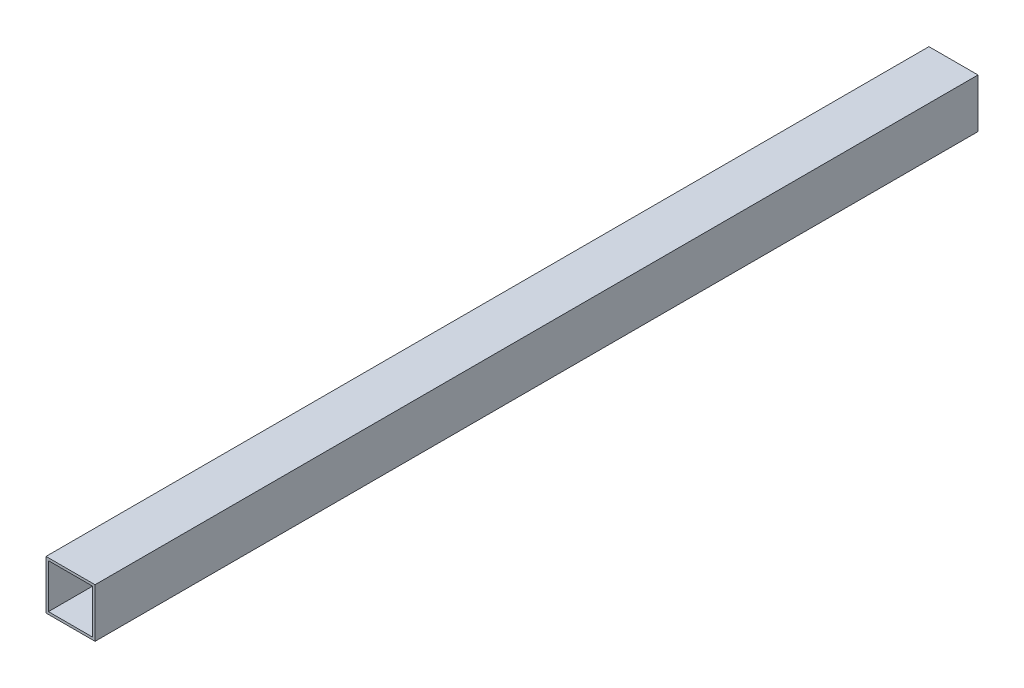
ISO-10303-21;
HEADER;
FILE_DESCRIPTION(('STEP AP214'),'2;1');
FILE_NAME('part.step','',(''),(''),'','','');
FILE_SCHEMA(('AUTOMOTIVE_DESIGN { 1 0 10303 214 1 1 1 1 }'));
ENDSEC;
DATA;
#1=APPLICATION_CONTEXT('core data for automotive mechanical design processes');
#2=APPLICATION_PROTOCOL_DEFINITION('international standard','automotive_design',2000,#1);
#3=PRODUCT_CONTEXT('',#1,'mechanical');
#4=PRODUCT('Part','Part','',(#3));
#5=PRODUCT_RELATED_PRODUCT_CATEGORY('part','',(#4));
#6=PRODUCT_DEFINITION_FORMATION('','',#4);
#7=PRODUCT_DEFINITION_CONTEXT('part definition',#1,'design');
#8=PRODUCT_DEFINITION('design','',#6,#7);
#9=PRODUCT_DEFINITION_SHAPE('','',#8);
#10=(LENGTH_UNIT() NAMED_UNIT(*) SI_UNIT(.MILLI.,.METRE.));
#11=(NAMED_UNIT(*) PLANE_ANGLE_UNIT() SI_UNIT($,.RADIAN.));
#12=(NAMED_UNIT(*) SI_UNIT($,.STERADIAN.) SOLID_ANGLE_UNIT());
#13=UNCERTAINTY_MEASURE_WITH_UNIT(LENGTH_MEASURE(1.E-05),#10,'distance_accuracy_value','');
#14=(GEOMETRIC_REPRESENTATION_CONTEXT(3) GLOBAL_UNCERTAINTY_ASSIGNED_CONTEXT((#13)) GLOBAL_UNIT_ASSIGNED_CONTEXT((#10,
#11,#12)) REPRESENTATION_CONTEXT('',''));
#15=CARTESIAN_POINT('',(0.,0.,0.));
#16=DIRECTION('',(0.,0.,1.));
#17=DIRECTION('',(1.,0.,0.));
#18=AXIS2_PLACEMENT_3D('',#15,#16,#17);
#19=CARTESIAN_POINT('',(0.,0.,360.));
#20=DIRECTION('',(0.,0.,1.));
#21=DIRECTION('',(1.,0.,0.));
#22=AXIS2_PLACEMENT_3D('',#19,#20,#21);
#23=PLANE('',#22);
#24=DIRECTION('',(0.,-1.,0.));
#25=VECTOR('',#24,1.);
#26=CARTESIAN_POINT('',(0.,0.,360.));
#27=LINE('',#26,#25);
#28=CARTESIAN_POINT('',(0.,0.,360.));
#29=VERTEX_POINT('',#28);
#30=CARTESIAN_POINT('',(0.,-20.,360.));
#31=VERTEX_POINT('',#30);
#32=EDGE_CURVE('E134',#29,#31,#27,.T.);
#33=ORIENTED_EDGE('',*,*,#32,.T.);
#34=DIRECTION('',(1.,0.,0.));
#35=VECTOR('',#34,1.);
#36=CARTESIAN_POINT('',(0.,-20.,360.));
#37=LINE('',#36,#35);
#38=CARTESIAN_POINT('',(20.,-20.,360.));
#39=VERTEX_POINT('',#38);
#40=EDGE_CURVE('E137',#31,#39,#37,.T.);
#41=ORIENTED_EDGE('',*,*,#40,.T.);
#42=DIRECTION('',(0.,1.,0.));
#43=VECTOR('',#42,1.);
#44=CARTESIAN_POINT('',(20.,0.,360.));
#45=LINE('',#44,#43);
#46=CARTESIAN_POINT('',(20.,0.,360.));
#47=VERTEX_POINT('',#46);
#48=EDGE_CURVE('E140',#39,#47,#45,.T.);
#49=ORIENTED_EDGE('',*,*,#48,.T.);
#50=DIRECTION('',(-1.,0.,0.));
#51=VECTOR('',#50,1.);
#52=CARTESIAN_POINT('',(0.,0.,360.));
#53=LINE('',#52,#51);
#54=EDGE_CURVE('E142',#47,#29,#53,.T.);
#55=ORIENTED_EDGE('',*,*,#54,.T.);
#56=EDGE_LOOP('',(#33,#41,#49,#55));
#57=FACE_BOUND('',#56,.T.);
#58=DIRECTION('',(-1.,0.,0.));
#59=VECTOR('',#58,1.);
#60=CARTESIAN_POINT('',(1.,-1.,360.));
#61=LINE('',#60,#59);
#62=CARTESIAN_POINT('',(19.,-1.,360.));
#63=VERTEX_POINT('',#62);
#64=CARTESIAN_POINT('',(1.,-1.,360.));
#65=VERTEX_POINT('',#64);
#66=EDGE_CURVE('E106',#63,#65,#61,.T.);
#67=ORIENTED_EDGE('',*,*,#66,.F.);
#68=DIRECTION('',(0.,1.,0.));
#69=VECTOR('',#68,1.);
#70=CARTESIAN_POINT('',(19.,-19.,360.));
#71=LINE('',#70,#69);
#72=CARTESIAN_POINT('',(19.,-19.,360.));
#73=VERTEX_POINT('',#72);
#74=EDGE_CURVE('E98',#73,#63,#71,.T.);
#75=ORIENTED_EDGE('',*,*,#74,.F.);
#76=DIRECTION('',(1.,0.,0.));
#77=VECTOR('',#76,1.);
#78=CARTESIAN_POINT('',(1.,-19.,360.));
#79=LINE('',#78,#77);
#80=CARTESIAN_POINT('',(1.,-19.,360.));
#81=VERTEX_POINT('',#80);
#82=EDGE_CURVE('E120',#81,#73,#79,.T.);
#83=ORIENTED_EDGE('',*,*,#82,.F.);
#84=DIRECTION('',(0.,-1.,0.));
#85=VECTOR('',#84,1.);
#86=CARTESIAN_POINT('',(1.,-19.,360.));
#87=LINE('',#86,#85);
#88=EDGE_CURVE('E118',#65,#81,#87,.T.);
#89=ORIENTED_EDGE('',*,*,#88,.F.);
#90=EDGE_LOOP('',(#67,#75,#83,#89));
#91=FACE_BOUND('',#90,.T.);
#92=ADVANCED_FACE('F33',(#57,#91),#23,.T.);
#93=CARTESIAN_POINT('',(0.,0.,0.));
#94=DIRECTION('',(0.,0.,1.));
#95=DIRECTION('',(1.,0.,0.));
#96=AXIS2_PLACEMENT_3D('',#93,#94,#95);
#97=PLANE('',#96);
#98=DIRECTION('',(0.,-1.,0.));
#99=VECTOR('',#98,1.);
#100=CARTESIAN_POINT('',(0.,0.,0.));
#101=LINE('',#100,#99);
#102=CARTESIAN_POINT('',(0.,0.,0.));
#103=VERTEX_POINT('',#102);
#104=CARTESIAN_POINT('',(0.,-20.,0.));
#105=VERTEX_POINT('',#104);
#106=EDGE_CURVE('E114',#103,#105,#101,.T.);
#107=ORIENTED_EDGE('',*,*,#106,.F.);
#108=DIRECTION('',(-1.,0.,0.));
#109=VECTOR('',#108,1.);
#110=CARTESIAN_POINT('',(0.,0.,0.));
#111=LINE('',#110,#109);
#112=CARTESIAN_POINT('',(20.,0.,0.));
#113=VERTEX_POINT('',#112);
#114=EDGE_CURVE('E138',#113,#103,#111,.T.);
#115=ORIENTED_EDGE('',*,*,#114,.F.);
#116=DIRECTION('',(0.,1.,0.));
#117=VECTOR('',#116,1.);
#118=CARTESIAN_POINT('',(20.,0.,0.));
#119=LINE('',#118,#117);
#120=CARTESIAN_POINT('',(20.,-20.,0.));
#121=VERTEX_POINT('',#120);
#122=EDGE_CURVE('E149',#121,#113,#119,.T.);
#123=ORIENTED_EDGE('',*,*,#122,.F.);
#124=DIRECTION('',(1.,0.,0.));
#125=VECTOR('',#124,1.);
#126=CARTESIAN_POINT('',(0.,-20.,0.));
#127=LINE('',#126,#125);
#128=EDGE_CURVE('E147',#105,#121,#127,.T.);
#129=ORIENTED_EDGE('',*,*,#128,.F.);
#130=EDGE_LOOP('',(#107,#115,#123,#129));
#131=FACE_BOUND('',#130,.T.);
#132=DIRECTION('',(0.,1.,0.));
#133=VECTOR('',#132,1.);
#134=CARTESIAN_POINT('',(19.,-19.,0.));
#135=LINE('',#134,#133);
#136=CARTESIAN_POINT('',(19.,-19.,0.));
#137=VERTEX_POINT('',#136);
#138=CARTESIAN_POINT('',(19.,-1.,0.));
#139=VERTEX_POINT('',#138);
#140=EDGE_CURVE('E56',#137,#139,#135,.T.);
#141=ORIENTED_EDGE('',*,*,#140,.T.);
#142=DIRECTION('',(-1.,0.,0.));
#143=VECTOR('',#142,1.);
#144=CARTESIAN_POINT('',(1.,-1.,0.));
#145=LINE('',#144,#143);
#146=CARTESIAN_POINT('',(1.,-1.,0.));
#147=VERTEX_POINT('',#146);
#148=EDGE_CURVE('E113',#139,#147,#145,.T.);
#149=ORIENTED_EDGE('',*,*,#148,.T.);
#150=DIRECTION('',(0.,-1.,0.));
#151=VECTOR('',#150,1.);
#152=CARTESIAN_POINT('',(1.,-19.,0.));
#153=LINE('',#152,#151);
#154=CARTESIAN_POINT('',(1.,-19.,0.));
#155=VERTEX_POINT('',#154);
#156=EDGE_CURVE('E126',#147,#155,#153,.T.);
#157=ORIENTED_EDGE('',*,*,#156,.T.);
#158=DIRECTION('',(1.,0.,0.));
#159=VECTOR('',#158,1.);
#160=CARTESIAN_POINT('',(1.,-19.,0.));
#161=LINE('',#160,#159);
#162=EDGE_CURVE('E107',#155,#137,#161,.T.);
#163=ORIENTED_EDGE('',*,*,#162,.T.);
#164=EDGE_LOOP('',(#141,#149,#157,#163));
#165=FACE_BOUND('',#164,.T.);
#166=ADVANCED_FACE('F167',(#131,#165),#97,.F.);
#167=CARTESIAN_POINT('',(0.,0.,360.));
#168=DIRECTION('',(1.,0.,0.));
#169=DIRECTION('',(0.,0.,-1.));
#170=AXIS2_PLACEMENT_3D('',#167,#168,#169);
#171=PLANE('',#170);
#172=ORIENTED_EDGE('',*,*,#106,.T.);
#173=DIRECTION('',(0.,0.,-1.));
#174=VECTOR('',#173,1.);
#175=CARTESIAN_POINT('',(0.,-20.,360.));
#176=LINE('',#175,#174);
#177=EDGE_CURVE('E11',#31,#105,#176,.T.);
#178=ORIENTED_EDGE('',*,*,#177,.F.);
#179=ORIENTED_EDGE('',*,*,#32,.F.);
#180=DIRECTION('',(0.,0.,-1.));
#181=VECTOR('',#180,1.);
#182=CARTESIAN_POINT('',(0.,0.,360.));
#183=LINE('',#182,#181);
#184=EDGE_CURVE('E144',#29,#103,#183,.T.);
#185=ORIENTED_EDGE('',*,*,#184,.T.);
#186=EDGE_LOOP('',(#172,#178,#179,#185));
#187=FACE_BOUND('',#186,.T.);
#188=ADVANCED_FACE('F35',(#187),#171,.F.);
#189=CARTESIAN_POINT('',(0.,-20.,360.));
#190=DIRECTION('',(0.,1.,0.));
#191=DIRECTION('',(0.,0.,1.));
#192=AXIS2_PLACEMENT_3D('',#189,#190,#191);
#193=PLANE('',#192);
#194=ORIENTED_EDGE('',*,*,#128,.T.);
#195=DIRECTION('',(0.,0.,-1.));
#196=VECTOR('',#195,1.);
#197=CARTESIAN_POINT('',(20.,-20.,360.));
#198=LINE('',#197,#196);
#199=EDGE_CURVE('E41',#39,#121,#198,.T.);
#200=ORIENTED_EDGE('',*,*,#199,.F.);
#201=ORIENTED_EDGE('',*,*,#40,.F.);
#202=ORIENTED_EDGE('',*,*,#177,.T.);
#203=EDGE_LOOP('',(#194,#200,#201,#202));
#204=FACE_BOUND('',#203,.T.);
#205=ADVANCED_FACE('F177',(#204),#193,.F.);
#206=CARTESIAN_POINT('',(20.,0.,360.));
#207=DIRECTION('',(-1.,0.,0.));
#208=DIRECTION('',(0.,-1.,0.));
#209=AXIS2_PLACEMENT_3D('',#206,#207,#208);
#210=PLANE('',#209);
#211=ORIENTED_EDGE('',*,*,#122,.T.);
#212=DIRECTION('',(0.,0.,-1.));
#213=VECTOR('',#212,1.);
#214=CARTESIAN_POINT('',(20.,0.,360.));
#215=LINE('',#214,#213);
#216=EDGE_CURVE('E154',#47,#113,#215,.T.);
#217=ORIENTED_EDGE('',*,*,#216,.F.);
#218=ORIENTED_EDGE('',*,*,#48,.F.);
#219=ORIENTED_EDGE('',*,*,#199,.T.);
#220=EDGE_LOOP('',(#211,#217,#218,#219));
#221=FACE_BOUND('',#220,.T.);
#222=ADVANCED_FACE('F161',(#221),#210,.F.);
#223=CARTESIAN_POINT('',(0.,0.,360.));
#224=DIRECTION('',(0.,-1.,0.));
#225=DIRECTION('',(0.,0.,-1.));
#226=AXIS2_PLACEMENT_3D('',#223,#224,#225);
#227=PLANE('',#226);
#228=ORIENTED_EDGE('',*,*,#114,.T.);
#229=ORIENTED_EDGE('',*,*,#184,.F.);
#230=ORIENTED_EDGE('',*,*,#54,.F.);
#231=ORIENTED_EDGE('',*,*,#216,.T.);
#232=EDGE_LOOP('',(#228,#229,#230,#231));
#233=FACE_BOUND('',#232,.T.);
#234=ADVANCED_FACE('F171',(#233),#227,.F.);
#235=CARTESIAN_POINT('',(19.,-19.,360.));
#236=DIRECTION('',(-1.,0.,0.));
#237=DIRECTION('',(0.,0.,1.));
#238=AXIS2_PLACEMENT_3D('',#235,#236,#237);
#239=PLANE('',#238);
#240=ORIENTED_EDGE('',*,*,#140,.F.);
#241=DIRECTION('',(0.,0.,-1.));
#242=VECTOR('',#241,1.);
#243=CARTESIAN_POINT('',(19.,-19.,360.));
#244=LINE('',#243,#242);
#245=EDGE_CURVE('E102',#73,#137,#244,.T.);
#246=ORIENTED_EDGE('',*,*,#245,.F.);
#247=ORIENTED_EDGE('',*,*,#74,.T.);
#248=DIRECTION('',(0.,0.,-1.));
#249=VECTOR('',#248,1.);
#250=CARTESIAN_POINT('',(19.,-1.,360.));
#251=LINE('',#250,#249);
#252=EDGE_CURVE('E101',#63,#139,#251,.T.);
#253=ORIENTED_EDGE('',*,*,#252,.T.);
#254=EDGE_LOOP('',(#240,#246,#247,#253));
#255=FACE_BOUND('',#254,.T.);
#256=ADVANCED_FACE('F100',(#255),#239,.T.);
#257=CARTESIAN_POINT('',(1.,-1.,360.));
#258=DIRECTION('',(0.,-1.,0.));
#259=DIRECTION('',(0.,0.,-1.));
#260=AXIS2_PLACEMENT_3D('',#257,#258,#259);
#261=PLANE('',#260);
#262=ORIENTED_EDGE('',*,*,#148,.F.);
#263=ORIENTED_EDGE('',*,*,#252,.F.);
#264=ORIENTED_EDGE('',*,*,#66,.T.);
#265=DIRECTION('',(0.,0.,-1.));
#266=VECTOR('',#265,1.);
#267=CARTESIAN_POINT('',(1.,-1.,360.));
#268=LINE('',#267,#266);
#269=EDGE_CURVE('E115',#65,#147,#268,.T.);
#270=ORIENTED_EDGE('',*,*,#269,.T.);
#271=EDGE_LOOP('',(#262,#263,#264,#270));
#272=FACE_BOUND('',#271,.T.);
#273=ADVANCED_FACE('F110',(#272),#261,.T.);
#274=CARTESIAN_POINT('',(1.,-19.,360.));
#275=DIRECTION('',(1.,0.,0.));
#276=DIRECTION('',(0.,0.,-1.));
#277=AXIS2_PLACEMENT_3D('',#274,#275,#276);
#278=PLANE('',#277);
#279=ORIENTED_EDGE('',*,*,#156,.F.);
#280=ORIENTED_EDGE('',*,*,#269,.F.);
#281=ORIENTED_EDGE('',*,*,#88,.T.);
#282=DIRECTION('',(0.,0.,-1.));
#283=VECTOR('',#282,1.);
#284=CARTESIAN_POINT('',(1.,-19.,360.));
#285=LINE('',#284,#283);
#286=EDGE_CURVE('E48',#81,#155,#285,.T.);
#287=ORIENTED_EDGE('',*,*,#286,.T.);
#288=EDGE_LOOP('',(#279,#280,#281,#287));
#289=FACE_BOUND('',#288,.T.);
#290=ADVANCED_FACE('F200',(#289),#278,.T.);
#291=CARTESIAN_POINT('',(1.,-19.,360.));
#292=DIRECTION('',(0.,1.,0.));
#293=DIRECTION('',(0.,0.,1.));
#294=AXIS2_PLACEMENT_3D('',#291,#292,#293);
#295=PLANE('',#294);
#296=ORIENTED_EDGE('',*,*,#162,.F.);
#297=ORIENTED_EDGE('',*,*,#286,.F.);
#298=ORIENTED_EDGE('',*,*,#82,.T.);
#299=ORIENTED_EDGE('',*,*,#245,.T.);
#300=EDGE_LOOP('',(#296,#297,#298,#299));
#301=FACE_BOUND('',#300,.T.);
#302=ADVANCED_FACE('F204',(#301),#295,.T.);
#303=CLOSED_SHELL('',(#92,#166,#188,#205,#222,#234,#256,#273,#290,#302));
#304=MANIFOLD_SOLID_BREP('B2',#303);
#305=ADVANCED_BREP_SHAPE_REPRESENTATION('',(#18,#304),#14);
#306=SHAPE_DEFINITION_REPRESENTATION(#9,#305);
ENDSEC;
END-ISO-10303-21;
